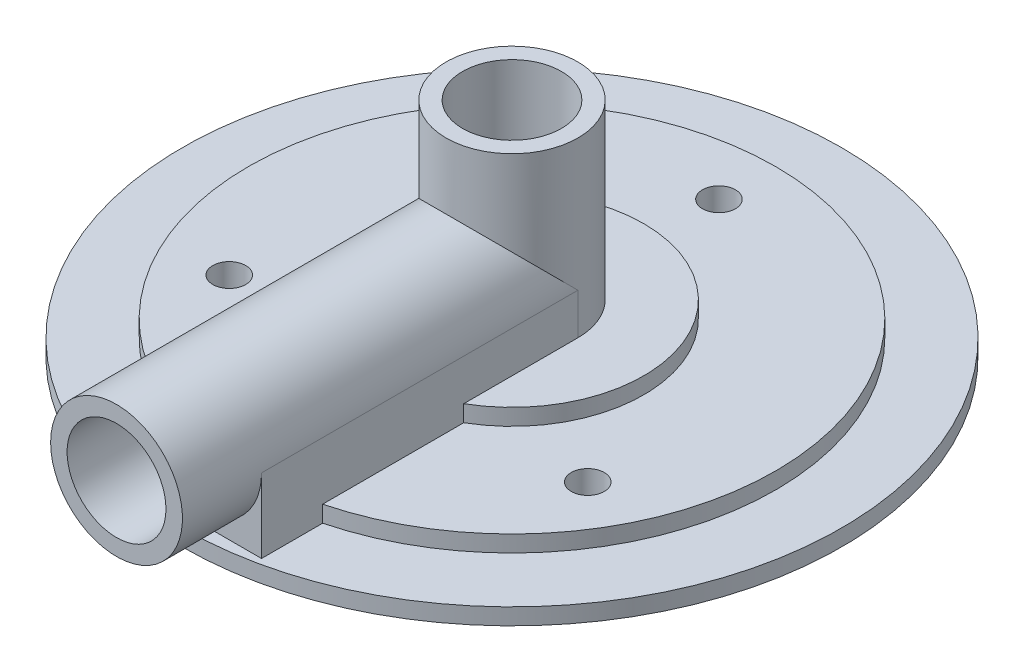
ISO-10303-21;
HEADER;
FILE_DESCRIPTION(('STEP AP214'),'2;1');
FILE_NAME('part.step','',(''),(''),'','','');
FILE_SCHEMA(('AUTOMOTIVE_DESIGN { 1 0 10303 214 1 1 1 1 }'));
ENDSEC;
DATA;
#1=APPLICATION_CONTEXT('core data for automotive mechanical design processes');
#2=APPLICATION_PROTOCOL_DEFINITION('international standard','automotive_design',2000,#1);
#3=PRODUCT_CONTEXT('',#1,'mechanical');
#4=PRODUCT('Part','Part','',(#3));
#5=PRODUCT_RELATED_PRODUCT_CATEGORY('part','',(#4));
#6=PRODUCT_DEFINITION_FORMATION('','',#4);
#7=PRODUCT_DEFINITION_CONTEXT('part definition',#1,'design');
#8=PRODUCT_DEFINITION('design','',#6,#7);
#9=PRODUCT_DEFINITION_SHAPE('','',#8);
#10=(LENGTH_UNIT() NAMED_UNIT(*) SI_UNIT(.MILLI.,.METRE.));
#11=(NAMED_UNIT(*) PLANE_ANGLE_UNIT() SI_UNIT($,.RADIAN.));
#12=(NAMED_UNIT(*) SI_UNIT($,.STERADIAN.) SOLID_ANGLE_UNIT());
#13=UNCERTAINTY_MEASURE_WITH_UNIT(LENGTH_MEASURE(1.E-05),#10,'distance_accuracy_value','');
#14=(GEOMETRIC_REPRESENTATION_CONTEXT(3) GLOBAL_UNCERTAINTY_ASSIGNED_CONTEXT((#13)) GLOBAL_UNIT_ASSIGNED_CONTEXT((#10,
#11,#12)) REPRESENTATION_CONTEXT('',''));
#15=CARTESIAN_POINT('',(0.,0.,0.));
#16=DIRECTION('',(0.,0.,1.));
#17=DIRECTION('',(1.,0.,0.));
#18=AXIS2_PLACEMENT_3D('',#15,#16,#17);
#19=CARTESIAN_POINT('',(0.,20.6375,0.));
#20=DIRECTION('',(0.,1.,0.));
#21=DIRECTION('',(0.,0.,1.));
#22=AXIS2_PLACEMENT_3D('',#19,#20,#21);
#23=CYLINDRICAL_SURFACE('',#22,6.35);
#24=CARTESIAN_POINT('',(0.,20.6375,0.));
#25=DIRECTION('',(0.,1.,0.));
#26=DIRECTION('',(0.,0.,1.));
#27=AXIS2_PLACEMENT_3D('',#24,#25,#26);
#28=CIRCLE('',#27,6.35);
#29=CARTESIAN_POINT('',(0.,20.6375,6.35));
#30=VERTEX_POINT('',#29);
#31=EDGE_CURVE('E117',#30,#30,#28,.T.);
#32=ORIENTED_EDGE('',*,*,#31,.F.);
#33=EDGE_LOOP('',(#32));
#34=FACE_BOUND('',#33,.T.);
#35=DIRECTION('',(0.,1.,0.));
#36=VECTOR('',#35,1.);
#37=CARTESIAN_POINT('',(6.35,20.6375,0.));
#38=LINE('',#37,#36);
#39=CARTESIAN_POINT('',(6.35,7.9375,0.));
#40=VERTEX_POINT('',#39);
#41=CARTESIAN_POINT('',(6.35,3.96875,0.));
#42=VERTEX_POINT('',#41);
#43=EDGE_CURVE('E168',#40,#42,#38,.F.);
#44=ORIENTED_EDGE('',*,*,#43,.T.);
#45=CARTESIAN_POINT('',(0.,3.96875,0.));
#46=DIRECTION('',(0.,1.,0.));
#47=DIRECTION('',(0.,0.,1.));
#48=AXIS2_PLACEMENT_3D('',#45,#46,#47);
#49=CIRCLE('',#48,6.35);
#50=CARTESIAN_POINT('',(-6.35,3.96875,0.));
#51=VERTEX_POINT('',#50);
#52=EDGE_CURVE('E243',#42,#51,#49,.T.);
#53=ORIENTED_EDGE('',*,*,#52,.T.);
#54=DIRECTION('',(0.,1.,0.));
#55=VECTOR('',#54,1.);
#56=CARTESIAN_POINT('',(-6.35,20.6375,0.));
#57=LINE('',#56,#55);
#58=CARTESIAN_POINT('',(-6.35,7.9375,0.));
#59=VERTEX_POINT('',#58);
#60=EDGE_CURVE('E159',#59,#51,#57,.F.);
#61=ORIENTED_EDGE('',*,*,#60,.F.);
#62=CARTESIAN_POINT('',(0.,7.9375,0.));
#63=DIRECTION('',(0.,0.707106781186547,-0.707106781186547));
#64=DIRECTION('',(0.,0.707106781186547,0.707106781186547));
#65=AXIS2_PLACEMENT_3D('',#62,#63,#64);
#66=ELLIPSE('',#65,8.98025612106916,6.35);
#67=EDGE_CURVE('E200',#40,#59,#66,.F.);
#68=ORIENTED_EDGE('',*,*,#67,.F.);
#69=EDGE_LOOP('',(#44,#53,#61,#68));
#70=FACE_BOUND('',#69,.T.);
#71=ADVANCED_FACE('F43',(#34,#70),#23,.T.);
#72=CARTESIAN_POINT('',(6.35,3.96875,0.));
#73=DIRECTION('',(0.,-1.,0.));
#74=DIRECTION('',(0.,0.,-1.));
#75=AXIS2_PLACEMENT_3D('',#72,#73,#74);
#76=PLANE('',#75);
#77=DIRECTION('',(0.,0.,1.));
#78=VECTOR('',#77,1.);
#79=CARTESIAN_POINT('',(6.35,3.96875,-31.752));
#80=LINE('',#79,#78);
#81=CARTESIAN_POINT('',(6.35,3.96875,10.9985226280624));
#82=VERTEX_POINT('',#81);
#83=EDGE_CURVE('E178',#42,#82,#80,.T.);
#84=ORIENTED_EDGE('',*,*,#83,.T.);
#85=CARTESIAN_POINT('',(0.,3.96875,0.));
#86=DIRECTION('',(0.,1.,0.));
#87=DIRECTION('',(0.,0.,1.));
#88=AXIS2_PLACEMENT_3D('',#85,#86,#87);
#89=CIRCLE('',#88,12.7);
#90=CARTESIAN_POINT('',(-6.35,3.96875,10.9985226280624));
#91=VERTEX_POINT('',#90);
#92=EDGE_CURVE('E240',#82,#91,#89,.T.);
#93=ORIENTED_EDGE('',*,*,#92,.T.);
#94=DIRECTION('',(0.,0.,-1.));
#95=VECTOR('',#94,1.);
#96=CARTESIAN_POINT('',(-6.35,3.96875,-31.752));
#97=LINE('',#96,#95);
#98=EDGE_CURVE('E66',#91,#51,#97,.T.);
#99=ORIENTED_EDGE('',*,*,#98,.T.);
#100=ORIENTED_EDGE('',*,*,#52,.F.);
#101=EDGE_LOOP('',(#84,#93,#99,#100));
#102=FACE_BOUND('',#101,.T.);
#103=ADVANCED_FACE('F284',(#102),#76,.F.);
#104=CARTESIAN_POINT('',(0.,20.6375,0.));
#105=DIRECTION('',(0.,1.,0.));
#106=DIRECTION('',(0.,0.,1.));
#107=AXIS2_PLACEMENT_3D('',#104,#105,#106);
#108=CYLINDRICAL_SURFACE('',#107,12.7);
#109=DIRECTION('',(0.,1.,0.));
#110=VECTOR('',#109,1.);
#111=CARTESIAN_POINT('',(6.35,20.6375,10.9985226280624));
#112=LINE('',#111,#110);
#113=CARTESIAN_POINT('',(6.35,2.38125,10.9985226280624));
#114=VERTEX_POINT('',#113);
#115=EDGE_CURVE('E172',#82,#114,#112,.F.);
#116=ORIENTED_EDGE('',*,*,#115,.T.);
#117=CARTESIAN_POINT('',(0.,2.38125,0.));
#118=DIRECTION('',(0.,1.,0.));
#119=DIRECTION('',(0.,0.,1.));
#120=AXIS2_PLACEMENT_3D('',#117,#118,#119);
#121=CIRCLE('',#120,12.7);
#122=CARTESIAN_POINT('',(-6.35,2.38125,10.9985226280624));
#123=VERTEX_POINT('',#122);
#124=EDGE_CURVE('E236',#114,#123,#121,.T.);
#125=ORIENTED_EDGE('',*,*,#124,.T.);
#126=DIRECTION('',(0.,1.,0.));
#127=VECTOR('',#126,1.);
#128=CARTESIAN_POINT('',(-6.35,20.6375,10.9985226280624));
#129=LINE('',#128,#127);
#130=EDGE_CURVE('E179',#123,#91,#129,.T.);
#131=ORIENTED_EDGE('',*,*,#130,.T.);
#132=ORIENTED_EDGE('',*,*,#92,.F.);
#133=EDGE_LOOP('',(#116,#125,#131,#132));
#134=FACE_BOUND('',#133,.T.);
#135=ADVANCED_FACE('F295',(#134),#108,.T.);
#136=CARTESIAN_POINT('',(12.7,2.38125,0.));
#137=DIRECTION('',(0.,-1.,0.));
#138=DIRECTION('',(0.,0.,-1.));
#139=AXIS2_PLACEMENT_3D('',#136,#137,#138);
#140=PLANE('',#139);
#141=CARTESIAN_POINT('',(0.,2.38125,-19.939));
#142=DIRECTION('',(0.,1.,0.));
#143=DIRECTION('',(0.,0.,1.));
#144=AXIS2_PLACEMENT_3D('',#141,#142,#143);
#145=CIRCLE('',#144,1.58750000000001);
#146=CARTESIAN_POINT('',(0.,2.38125,-18.3515));
#147=VERTEX_POINT('',#146);
#148=EDGE_CURVE('E269',#147,#147,#145,.T.);
#149=ORIENTED_EDGE('',*,*,#148,.F.);
#150=EDGE_LOOP('',(#149));
#151=FACE_BOUND('',#150,.T.);
#152=CARTESIAN_POINT('',(17.2676805260579,2.38125,9.9695));
#153=DIRECTION('',(0.,1.,0.));
#154=DIRECTION('',(0.,0.,1.));
#155=AXIS2_PLACEMENT_3D('',#152,#153,#154);
#156=CIRCLE('',#155,1.58750000000001);
#157=CARTESIAN_POINT('',(17.2676805260579,2.38125,11.557));
#158=VERTEX_POINT('',#157);
#159=EDGE_CURVE('E256',#158,#158,#156,.T.);
#160=ORIENTED_EDGE('',*,*,#159,.F.);
#161=EDGE_LOOP('',(#160));
#162=FACE_BOUND('',#161,.T.);
#163=CARTESIAN_POINT('',(-17.2676805260579,2.38125,9.96949999999999));
#164=DIRECTION('',(0.,1.,0.));
#165=DIRECTION('',(0.,0.,1.));
#166=AXIS2_PLACEMENT_3D('',#163,#164,#165);
#167=CIRCLE('',#166,1.58750000000001);
#168=CARTESIAN_POINT('',(-17.2676805260579,2.38125,11.557));
#169=VERTEX_POINT('',#168);
#170=EDGE_CURVE('E252',#169,#169,#167,.T.);
#171=ORIENTED_EDGE('',*,*,#170,.F.);
#172=EDGE_LOOP('',(#171));
#173=FACE_BOUND('',#172,.T.);
#174=DIRECTION('',(0.,0.,1.));
#175=VECTOR('',#174,1.);
#176=CARTESIAN_POINT('',(6.35,2.38125,-31.752));
#177=LINE('',#176,#175);
#178=CARTESIAN_POINT('',(6.35,2.38125,24.5934442484171));
#179=VERTEX_POINT('',#178);
#180=EDGE_CURVE('E169',#114,#179,#177,.T.);
#181=ORIENTED_EDGE('',*,*,#180,.T.);
#182=CARTESIAN_POINT('',(0.,2.38125,0.));
#183=DIRECTION('',(0.,1.,0.));
#184=DIRECTION('',(0.,0.,1.));
#185=AXIS2_PLACEMENT_3D('',#182,#183,#184);
#186=CIRCLE('',#185,25.4);
#187=CARTESIAN_POINT('',(-6.35,2.38125,24.5934442484171));
#188=VERTEX_POINT('',#187);
#189=EDGE_CURVE('E232',#179,#188,#186,.T.);
#190=ORIENTED_EDGE('',*,*,#189,.T.);
#191=DIRECTION('',(0.,0.,-1.));
#192=VECTOR('',#191,1.);
#193=CARTESIAN_POINT('',(-6.35,2.38125,-31.752));
#194=LINE('',#193,#192);
#195=EDGE_CURVE('E182',#188,#123,#194,.T.);
#196=ORIENTED_EDGE('',*,*,#195,.T.);
#197=ORIENTED_EDGE('',*,*,#124,.F.);
#198=EDGE_LOOP('',(#181,#190,#196,#197));
#199=FACE_BOUND('',#198,.T.);
#200=ADVANCED_FACE('F298',(#151,#162,#173,#199),#140,.F.);
#201=CARTESIAN_POINT('',(0.,20.6375,0.));
#202=DIRECTION('',(0.,1.,0.));
#203=DIRECTION('',(0.,0.,1.));
#204=AXIS2_PLACEMENT_3D('',#201,#202,#203);
#205=CYLINDRICAL_SURFACE('',#204,25.4);
#206=DIRECTION('',(0.,1.,0.));
#207=VECTOR('',#206,1.);
#208=CARTESIAN_POINT('',(6.35,20.6375,24.5934442484171));
#209=LINE('',#208,#207);
#210=CARTESIAN_POINT('',(6.35,0.793749999999999,24.5934442484171));
#211=VERTEX_POINT('',#210);
#212=EDGE_CURVE('E173',#179,#211,#209,.F.);
#213=ORIENTED_EDGE('',*,*,#212,.T.);
#214=CARTESIAN_POINT('',(0.,0.793749999999999,0.));
#215=DIRECTION('',(0.,1.,0.));
#216=DIRECTION('',(0.,0.,1.));
#217=AXIS2_PLACEMENT_3D('',#214,#215,#216);
#218=CIRCLE('',#217,25.4);
#219=CARTESIAN_POINT('',(-6.35,0.793749999999999,24.5934442484171));
#220=VERTEX_POINT('',#219);
#221=EDGE_CURVE('E228',#211,#220,#218,.T.);
#222=ORIENTED_EDGE('',*,*,#221,.T.);
#223=DIRECTION('',(0.,1.,0.));
#224=VECTOR('',#223,1.);
#225=CARTESIAN_POINT('',(-6.35,20.6375,24.5934442484171));
#226=LINE('',#225,#224);
#227=EDGE_CURVE('E188',#220,#188,#226,.T.);
#228=ORIENTED_EDGE('',*,*,#227,.T.);
#229=ORIENTED_EDGE('',*,*,#189,.F.);
#230=EDGE_LOOP('',(#213,#222,#228,#229));
#231=FACE_BOUND('',#230,.T.);
#232=ADVANCED_FACE('F317',(#231),#205,.T.);
#233=CARTESIAN_POINT('',(25.4,0.79375,0.));
#234=DIRECTION('',(0.,-1.,0.));
#235=DIRECTION('',(0.,0.,-1.));
#236=AXIS2_PLACEMENT_3D('',#233,#234,#235);
#237=PLANE('',#236);
#238=CARTESIAN_POINT('',(0.,0.793749999999999,0.));
#239=DIRECTION('',(0.,1.,0.));
#240=DIRECTION('',(0.,0.,1.));
#241=AXIS2_PLACEMENT_3D('',#238,#239,#240);
#242=CIRCLE('',#241,31.75);
#243=CARTESIAN_POINT('',(0.,0.793749999999999,31.75));
#244=VERTEX_POINT('',#243);
#245=EDGE_CURVE('E224',#244,#244,#242,.T.);
#246=ORIENTED_EDGE('',*,*,#245,.T.);
#247=EDGE_LOOP('',(#246));
#248=FACE_BOUND('',#247,.T.);
#249=DIRECTION('',(0.,0.,1.));
#250=VECTOR('',#249,1.);
#251=CARTESIAN_POINT('',(6.35,0.793749999999999,-31.752));
#252=LINE('',#251,#250);
#253=CARTESIAN_POINT('',(6.35,0.79375,30.48));
#254=VERTEX_POINT('',#253);
#255=EDGE_CURVE('E160',#211,#254,#252,.T.);
#256=ORIENTED_EDGE('',*,*,#255,.T.);
#257=DIRECTION('',(-1.,0.,0.));
#258=VECTOR('',#257,1.);
#259=CARTESIAN_POINT('',(-6.35,0.793749999999999,30.48));
#260=LINE('',#259,#258);
#261=CARTESIAN_POINT('',(-6.35,0.79375,30.48));
#262=VERTEX_POINT('',#261);
#263=EDGE_CURVE('E136',#254,#262,#260,.T.);
#264=ORIENTED_EDGE('',*,*,#263,.T.);
#265=DIRECTION('',(0.,0.,1.));
#266=VECTOR('',#265,1.);
#267=CARTESIAN_POINT('',(-6.35,0.793749999999999,-31.752));
#268=LINE('',#267,#266);
#269=EDGE_CURVE('E155',#220,#262,#268,.T.);
#270=ORIENTED_EDGE('',*,*,#269,.F.);
#271=ORIENTED_EDGE('',*,*,#221,.F.);
#272=EDGE_LOOP('',(#256,#264,#270,#271));
#273=FACE_BOUND('',#272,.T.);
#274=ADVANCED_FACE('F279',(#248,#273),#237,.F.);
#275=CARTESIAN_POINT('',(0.,20.6375,0.));
#276=DIRECTION('',(0.,-1.,0.));
#277=DIRECTION('',(0.,0.,-1.));
#278=AXIS2_PLACEMENT_3D('',#275,#276,#277);
#279=PLANE('',#278);
#280=CARTESIAN_POINT('',(0.,20.6375,0.));
#281=DIRECTION('',(0.,1.,0.));
#282=DIRECTION('',(0.,0.,1.));
#283=AXIS2_PLACEMENT_3D('',#280,#281,#282);
#284=CIRCLE('',#283,4.76250000000001);
#285=CARTESIAN_POINT('',(0.,20.6375,4.76250000000001));
#286=VERTEX_POINT('',#285);
#287=EDGE_CURVE('E139',#286,#286,#284,.T.);
#288=ORIENTED_EDGE('',*,*,#287,.F.);
#289=EDGE_LOOP('',(#288));
#290=FACE_BOUND('',#289,.T.);
#291=ORIENTED_EDGE('',*,*,#31,.T.);
#292=EDGE_LOOP('',(#291));
#293=FACE_BOUND('',#292,.T.);
#294=ADVANCED_FACE('F45',(#290,#293),#279,.F.);
#295=CARTESIAN_POINT('',(0.,20.6375,0.));
#296=DIRECTION('',(0.,1.,0.));
#297=DIRECTION('',(0.,0.,1.));
#298=AXIS2_PLACEMENT_3D('',#295,#296,#297);
#299=CYLINDRICAL_SURFACE('',#298,31.75);
#300=ORIENTED_EDGE('',*,*,#245,.F.);
#301=EDGE_LOOP('',(#300));
#302=FACE_BOUND('',#301,.T.);
#303=CARTESIAN_POINT('',(0.,-0.793749999999999,0.));
#304=DIRECTION('',(0.,1.,0.));
#305=DIRECTION('',(0.,0.,1.));
#306=AXIS2_PLACEMENT_3D('',#303,#304,#305);
#307=CIRCLE('',#306,31.75);
#308=CARTESIAN_POINT('',(0.,-0.793749999999999,31.75));
#309=VERTEX_POINT('',#308);
#310=EDGE_CURVE('E220',#309,#309,#307,.T.);
#311=ORIENTED_EDGE('',*,*,#310,.T.);
#312=EDGE_LOOP('',(#311));
#313=FACE_BOUND('',#312,.T.);
#314=ADVANCED_FACE('F278',(#302,#313),#299,.T.);
#315=CARTESIAN_POINT('',(25.4,-0.79375,0.));
#316=DIRECTION('',(0.,1.,0.));
#317=DIRECTION('',(0.,0.,1.));
#318=AXIS2_PLACEMENT_3D('',#315,#316,#317);
#319=PLANE('',#318);
#320=ORIENTED_EDGE('',*,*,#310,.F.);
#321=EDGE_LOOP('',(#320));
#322=FACE_BOUND('',#321,.T.);
#323=CARTESIAN_POINT('',(0.,-0.793749999999999,0.));
#324=DIRECTION('',(0.,1.,0.));
#325=DIRECTION('',(0.,0.,1.));
#326=AXIS2_PLACEMENT_3D('',#323,#324,#325);
#327=CIRCLE('',#326,25.4);
#328=CARTESIAN_POINT('',(0.,-0.793749999999999,25.4));
#329=VERTEX_POINT('',#328);
#330=EDGE_CURVE('E216',#329,#329,#327,.T.);
#331=ORIENTED_EDGE('',*,*,#330,.T.);
#332=EDGE_LOOP('',(#331));
#333=FACE_BOUND('',#332,.T.);
#334=ADVANCED_FACE('F525',(#322,#333),#319,.F.);
#335=CARTESIAN_POINT('',(0.,20.6375,0.));
#336=DIRECTION('',(0.,1.,0.));
#337=DIRECTION('',(0.,0.,1.));
#338=AXIS2_PLACEMENT_3D('',#335,#336,#337);
#339=CYLINDRICAL_SURFACE('',#338,25.4);
#340=ORIENTED_EDGE('',*,*,#330,.F.);
#341=EDGE_LOOP('',(#340));
#342=FACE_BOUND('',#341,.T.);
#343=CARTESIAN_POINT('',(0.,-2.38125,0.));
#344=DIRECTION('',(0.,1.,0.));
#345=DIRECTION('',(0.,0.,1.));
#346=AXIS2_PLACEMENT_3D('',#343,#344,#345);
#347=CIRCLE('',#346,25.4);
#348=CARTESIAN_POINT('',(0.,-2.38125,25.4));
#349=VERTEX_POINT('',#348);
#350=EDGE_CURVE('E212',#349,#349,#347,.T.);
#351=ORIENTED_EDGE('',*,*,#350,.T.);
#352=EDGE_LOOP('',(#351));
#353=FACE_BOUND('',#352,.T.);
#354=ADVANCED_FACE('F362',(#342,#353),#339,.T.);
#355=CARTESIAN_POINT('',(12.7,-2.38125,0.));
#356=DIRECTION('',(0.,1.,0.));
#357=DIRECTION('',(0.,0.,1.));
#358=AXIS2_PLACEMENT_3D('',#355,#356,#357);
#359=PLANE('',#358);
#360=CARTESIAN_POINT('',(0.,-2.38125,-19.939));
#361=DIRECTION('',(0.,1.,0.));
#362=DIRECTION('',(0.,0.,1.));
#363=AXIS2_PLACEMENT_3D('',#360,#361,#362);
#364=CIRCLE('',#363,1.58750000000001);
#365=CARTESIAN_POINT('',(0.,-2.38125,-18.3515));
#366=VERTEX_POINT('',#365);
#367=EDGE_CURVE('E47',#366,#366,#364,.T.);
#368=ORIENTED_EDGE('',*,*,#367,.T.);
#369=EDGE_LOOP('',(#368));
#370=FACE_BOUND('',#369,.T.);
#371=CARTESIAN_POINT('',(17.2676805260579,-2.38125,9.9695));
#372=DIRECTION('',(0.,1.,0.));
#373=DIRECTION('',(0.,0.,1.));
#374=AXIS2_PLACEMENT_3D('',#371,#372,#373);
#375=CIRCLE('',#374,1.58750000000001);
#376=CARTESIAN_POINT('',(17.2676805260579,-2.38125,11.557));
#377=VERTEX_POINT('',#376);
#378=EDGE_CURVE('E253',#377,#377,#375,.T.);
#379=ORIENTED_EDGE('',*,*,#378,.T.);
#380=EDGE_LOOP('',(#379));
#381=FACE_BOUND('',#380,.T.);
#382=CARTESIAN_POINT('',(-17.2676805260579,-2.38125,9.96949999999999));
#383=DIRECTION('',(0.,1.,0.));
#384=DIRECTION('',(0.,0.,1.));
#385=AXIS2_PLACEMENT_3D('',#382,#383,#384);
#386=CIRCLE('',#385,1.58750000000001);
#387=CARTESIAN_POINT('',(-17.2676805260579,-2.38125,11.557));
#388=VERTEX_POINT('',#387);
#389=EDGE_CURVE('E249',#388,#388,#386,.T.);
#390=ORIENTED_EDGE('',*,*,#389,.T.);
#391=EDGE_LOOP('',(#390));
#392=FACE_BOUND('',#391,.T.);
#393=ORIENTED_EDGE('',*,*,#350,.F.);
#394=EDGE_LOOP('',(#393));
#395=FACE_BOUND('',#394,.T.);
#396=CARTESIAN_POINT('',(0.,-2.38125,0.));
#397=DIRECTION('',(0.,1.,0.));
#398=DIRECTION('',(0.,0.,1.));
#399=AXIS2_PLACEMENT_3D('',#396,#397,#398);
#400=CIRCLE('',#399,12.7);
#401=CARTESIAN_POINT('',(0.,-2.38125,12.7));
#402=VERTEX_POINT('',#401);
#403=EDGE_CURVE('E208',#402,#402,#400,.T.);
#404=ORIENTED_EDGE('',*,*,#403,.T.);
#405=EDGE_LOOP('',(#404));
#406=FACE_BOUND('',#405,.T.);
#407=ADVANCED_FACE('F356',(#370,#381,#392,#395,#406),#359,.F.);
#408=CARTESIAN_POINT('',(0.,20.6375,0.));
#409=DIRECTION('',(0.,1.,0.));
#410=DIRECTION('',(0.,0.,1.));
#411=AXIS2_PLACEMENT_3D('',#408,#409,#410);
#412=CYLINDRICAL_SURFACE('',#411,12.7);
#413=ORIENTED_EDGE('',*,*,#403,.F.);
#414=EDGE_LOOP('',(#413));
#415=FACE_BOUND('',#414,.T.);
#416=CARTESIAN_POINT('',(0.,-3.96875,0.));
#417=DIRECTION('',(0.,1.,0.));
#418=DIRECTION('',(0.,0.,1.));
#419=AXIS2_PLACEMENT_3D('',#416,#417,#418);
#420=CIRCLE('',#419,12.7);
#421=CARTESIAN_POINT('',(0.,-3.96875,12.7));
#422=VERTEX_POINT('',#421);
#423=EDGE_CURVE('E204',#422,#422,#420,.T.);
#424=ORIENTED_EDGE('',*,*,#423,.T.);
#425=EDGE_LOOP('',(#424));
#426=FACE_BOUND('',#425,.T.);
#427=ADVANCED_FACE('F361',(#415,#426),#412,.T.);
#428=CARTESIAN_POINT('',(6.35,-3.96875,0.));
#429=DIRECTION('',(0.,1.,0.));
#430=DIRECTION('',(0.,0.,1.));
#431=AXIS2_PLACEMENT_3D('',#428,#429,#430);
#432=PLANE('',#431);
#433=CARTESIAN_POINT('',(0.,-3.96875,0.));
#434=DIRECTION('',(0.,1.,0.));
#435=DIRECTION('',(0.,0.,1.));
#436=AXIS2_PLACEMENT_3D('',#433,#434,#435);
#437=CIRCLE('',#436,4.76250000000001);
#438=CARTESIAN_POINT('',(0.,-3.96875,4.76250000000001));
#439=VERTEX_POINT('',#438);
#440=EDGE_CURVE('E131',#439,#439,#437,.T.);
#441=ORIENTED_EDGE('',*,*,#440,.T.);
#442=EDGE_LOOP('',(#441));
#443=FACE_BOUND('',#442,.T.);
#444=ORIENTED_EDGE('',*,*,#423,.F.);
#445=EDGE_LOOP('',(#444));
#446=FACE_BOUND('',#445,.T.);
#447=ADVANCED_FACE('F486',(#443,#446),#432,.F.);
#448=CARTESIAN_POINT('',(0.,7.9375,0.));
#449=DIRECTION('',(0.,0.,-1.));
#450=DIRECTION('',(-1.,0.,0.));
#451=AXIS2_PLACEMENT_3D('',#448,#449,#450);
#452=CYLINDRICAL_SURFACE('',#451,6.35);
#453=CARTESIAN_POINT('',(0.,7.9375,30.48));
#454=DIRECTION('',(0.,0.,-1.));
#455=DIRECTION('',(-1.,0.,0.));
#456=AXIS2_PLACEMENT_3D('',#453,#454,#455);
#457=CIRCLE('',#456,6.35);
#458=CARTESIAN_POINT('',(-6.35,7.9375,30.48));
#459=VERTEX_POINT('',#458);
#460=CARTESIAN_POINT('',(6.35,7.9375,30.48));
#461=VERTEX_POINT('',#460);
#462=EDGE_CURVE('E154',#459,#461,#457,.F.);
#463=ORIENTED_EDGE('',*,*,#462,.T.);
#464=DIRECTION('',(0.,0.,1.));
#465=VECTOR('',#464,1.);
#466=CARTESIAN_POINT('',(6.35,7.9375,-31.752));
#467=LINE('',#466,#465);
#468=EDGE_CURVE('E147',#40,#461,#467,.T.);
#469=ORIENTED_EDGE('',*,*,#468,.F.);
#470=ORIENTED_EDGE('',*,*,#67,.T.);
#471=DIRECTION('',(0.,0.,1.));
#472=VECTOR('',#471,1.);
#473=CARTESIAN_POINT('',(-6.35,7.9375,-31.752));
#474=LINE('',#473,#472);
#475=EDGE_CURVE('E150',#59,#459,#474,.T.);
#476=ORIENTED_EDGE('',*,*,#475,.T.);
#477=EDGE_LOOP('',(#463,#469,#470,#476));
#478=FACE_BOUND('',#477,.T.);
#479=CARTESIAN_POINT('',(0.,7.9375,38.1));
#480=DIRECTION('',(0.,0.,-1.));
#481=DIRECTION('',(-1.,0.,0.));
#482=AXIS2_PLACEMENT_3D('',#479,#480,#481);
#483=CIRCLE('',#482,6.35);
#484=CARTESIAN_POINT('',(-6.35,7.9375,38.1));
#485=VERTEX_POINT('',#484);
#486=EDGE_CURVE('E153',#485,#485,#483,.T.);
#487=ORIENTED_EDGE('',*,*,#486,.T.);
#488=EDGE_LOOP('',(#487));
#489=FACE_BOUND('',#488,.T.);
#490=ADVANCED_FACE('F306',(#478,#489),#452,.T.);
#491=CARTESIAN_POINT('',(0.,7.9375,38.1));
#492=DIRECTION('',(0.,0.,-1.));
#493=DIRECTION('',(-1.,0.,0.));
#494=AXIS2_PLACEMENT_3D('',#491,#492,#493);
#495=PLANE('',#494);
#496=CARTESIAN_POINT('',(0.,7.9375,38.1));
#497=DIRECTION('',(0.,0.,1.));
#498=DIRECTION('',(1.,0.,0.));
#499=AXIS2_PLACEMENT_3D('',#496,#497,#498);
#500=CIRCLE('',#499,4.76250000000001);
#501=CARTESIAN_POINT('',(4.76250000000001,7.9375,38.1));
#502=VERTEX_POINT('',#501);
#503=EDGE_CURVE('E127',#502,#502,#500,.T.);
#504=ORIENTED_EDGE('',*,*,#503,.F.);
#505=EDGE_LOOP('',(#504));
#506=FACE_BOUND('',#505,.T.);
#507=ORIENTED_EDGE('',*,*,#486,.F.);
#508=EDGE_LOOP('',(#507));
#509=FACE_BOUND('',#508,.T.);
#510=ADVANCED_FACE('F424',(#506,#509),#495,.F.);
#511=CARTESIAN_POINT('',(6.35,7.9375,-31.752));
#512=DIRECTION('',(-1.,0.,0.));
#513=DIRECTION('',(0.,-1.,0.));
#514=AXIS2_PLACEMENT_3D('',#511,#512,#513);
#515=PLANE('',#514);
#516=ORIENTED_EDGE('',*,*,#212,.F.);
#517=ORIENTED_EDGE('',*,*,#180,.F.);
#518=ORIENTED_EDGE('',*,*,#115,.F.);
#519=ORIENTED_EDGE('',*,*,#83,.F.);
#520=ORIENTED_EDGE('',*,*,#43,.F.);
#521=ORIENTED_EDGE('',*,*,#468,.T.);
#522=DIRECTION('',(0.,-1.,0.));
#523=VECTOR('',#522,1.);
#524=CARTESIAN_POINT('',(6.35,7.9375,30.48));
#525=LINE('',#524,#523);
#526=EDGE_CURVE('E143',#461,#254,#525,.T.);
#527=ORIENTED_EDGE('',*,*,#526,.T.);
#528=ORIENTED_EDGE('',*,*,#255,.F.);
#529=EDGE_LOOP('',(#516,#517,#518,#519,#520,#521,#527,#528));
#530=FACE_BOUND('',#529,.T.);
#531=ADVANCED_FACE('F124',(#530),#515,.F.);
#532=CARTESIAN_POINT('',(-6.35,7.9375,-31.752));
#533=DIRECTION('',(1.,0.,0.));
#534=DIRECTION('',(0.,0.,-1.));
#535=AXIS2_PLACEMENT_3D('',#532,#533,#534);
#536=PLANE('',#535);
#537=ORIENTED_EDGE('',*,*,#227,.F.);
#538=ORIENTED_EDGE('',*,*,#269,.T.);
#539=DIRECTION('',(0.,1.,0.));
#540=VECTOR('',#539,1.);
#541=CARTESIAN_POINT('',(-6.35,7.9375,30.48));
#542=LINE('',#541,#540);
#543=EDGE_CURVE('E130',#262,#459,#542,.T.);
#544=ORIENTED_EDGE('',*,*,#543,.T.);
#545=ORIENTED_EDGE('',*,*,#475,.F.);
#546=ORIENTED_EDGE('',*,*,#60,.T.);
#547=ORIENTED_EDGE('',*,*,#98,.F.);
#548=ORIENTED_EDGE('',*,*,#130,.F.);
#549=ORIENTED_EDGE('',*,*,#195,.F.);
#550=EDGE_LOOP('',(#537,#538,#544,#545,#546,#547,#548,#549));
#551=FACE_BOUND('',#550,.T.);
#552=ADVANCED_FACE('F303',(#551),#536,.F.);
#553=CARTESIAN_POINT('',(0.,0.,30.48));
#554=DIRECTION('',(0.,0.,-1.));
#555=DIRECTION('',(-1.,0.,0.));
#556=AXIS2_PLACEMENT_3D('',#553,#554,#555);
#557=PLANE('',#556);
#558=ORIENTED_EDGE('',*,*,#462,.F.);
#559=ORIENTED_EDGE('',*,*,#543,.F.);
#560=ORIENTED_EDGE('',*,*,#263,.F.);
#561=ORIENTED_EDGE('',*,*,#526,.F.);
#562=EDGE_LOOP('',(#558,#559,#560,#561));
#563=FACE_BOUND('',#562,.T.);
#564=ADVANCED_FACE('F122',(#563),#557,.F.);
#565=CARTESIAN_POINT('',(0.,7.9375,38.1));
#566=DIRECTION('',(0.,0.,1.));
#567=DIRECTION('',(1.,0.,0.));
#568=AXIS2_PLACEMENT_3D('',#565,#566,#567);
#569=CYLINDRICAL_SURFACE('',#568,4.76250000000001);
#570=CARTESIAN_POINT('',(0.,7.9375,0.));
#571=DIRECTION('',(0.,-0.707106781186547,0.707106781186547));
#572=DIRECTION('',(0.,0.707106781186547,0.707106781186547));
#573=AXIS2_PLACEMENT_3D('',#570,#571,#572);
#574=ELLIPSE('',#573,6.73519209080188,4.76250000000001);
#575=CARTESIAN_POINT('',(-4.76250000000001,7.9375,0.));
#576=VERTEX_POINT('',#575);
#577=CARTESIAN_POINT('',(4.76250000000001,7.9375,0.));
#578=VERTEX_POINT('',#577);
#579=EDGE_CURVE('E53',#576,#578,#574,.F.);
#580=ORIENTED_EDGE('',*,*,#579,.T.);
#581=CARTESIAN_POINT('',(0.,7.9375,0.));
#582=DIRECTION('',(0.,0.707106781186547,0.707106781186547));
#583=DIRECTION('',(0.,-0.707106781186547,0.707106781186547));
#584=AXIS2_PLACEMENT_3D('',#581,#582,#583);
#585=ELLIPSE('',#584,6.73519209080188,4.76250000000001);
#586=EDGE_CURVE('E11',#578,#576,#585,.F.);
#587=ORIENTED_EDGE('',*,*,#586,.T.);
#588=EDGE_LOOP('',(#580,#587));
#589=FACE_BOUND('',#588,.T.);
#590=ORIENTED_EDGE('',*,*,#503,.T.);
#591=EDGE_LOOP('',(#590));
#592=FACE_BOUND('',#591,.T.);
#593=ADVANCED_FACE('F119',(#589,#592),#569,.F.);
#594=CARTESIAN_POINT('',(0.,20.6375,0.));
#595=DIRECTION('',(0.,1.,0.));
#596=DIRECTION('',(0.,0.,1.));
#597=AXIS2_PLACEMENT_3D('',#594,#595,#596);
#598=CYLINDRICAL_SURFACE('',#597,4.76250000000001);
#599=ORIENTED_EDGE('',*,*,#440,.F.);
#600=EDGE_LOOP('',(#599));
#601=FACE_BOUND('',#600,.T.);
#602=ORIENTED_EDGE('',*,*,#287,.T.);
#603=EDGE_LOOP('',(#602));
#604=FACE_BOUND('',#603,.T.);
#605=ORIENTED_EDGE('',*,*,#579,.F.);
#606=ORIENTED_EDGE('',*,*,#586,.F.);
#607=EDGE_LOOP('',(#605,#606));
#608=FACE_BOUND('',#607,.T.);
#609=ADVANCED_FACE('F114',(#601,#604,#608),#598,.F.);
#610=CARTESIAN_POINT('',(-17.2676805260579,2.38125,9.96949999999999));
#611=DIRECTION('',(0.,1.,0.));
#612=DIRECTION('',(0.,0.,1.));
#613=AXIS2_PLACEMENT_3D('',#610,#611,#612);
#614=CYLINDRICAL_SURFACE('',#613,1.58750000000001);
#615=ORIENTED_EDGE('',*,*,#170,.T.);
#616=EDGE_LOOP('',(#615));
#617=FACE_BOUND('',#616,.T.);
#618=ORIENTED_EDGE('',*,*,#389,.F.);
#619=EDGE_LOOP('',(#618));
#620=FACE_BOUND('',#619,.T.);
#621=ADVANCED_FACE('F373',(#617,#620),#614,.F.);
#622=CARTESIAN_POINT('',(17.2676805260579,2.38125,9.9695));
#623=DIRECTION('',(0.,1.,0.));
#624=DIRECTION('',(0.,0.,1.));
#625=AXIS2_PLACEMENT_3D('',#622,#623,#624);
#626=CYLINDRICAL_SURFACE('',#625,1.58750000000001);
#627=ORIENTED_EDGE('',*,*,#159,.T.);
#628=EDGE_LOOP('',(#627));
#629=FACE_BOUND('',#628,.T.);
#630=ORIENTED_EDGE('',*,*,#378,.F.);
#631=EDGE_LOOP('',(#630));
#632=FACE_BOUND('',#631,.T.);
#633=ADVANCED_FACE('F378',(#629,#632),#626,.F.);
#634=CARTESIAN_POINT('',(0.,2.38125,-19.939));
#635=DIRECTION('',(0.,1.,0.));
#636=DIRECTION('',(0.,0.,1.));
#637=AXIS2_PLACEMENT_3D('',#634,#635,#636);
#638=CYLINDRICAL_SURFACE('',#637,1.58750000000001);
#639=ORIENTED_EDGE('',*,*,#148,.T.);
#640=EDGE_LOOP('',(#639));
#641=FACE_BOUND('',#640,.T.);
#642=ORIENTED_EDGE('',*,*,#367,.F.);
#643=EDGE_LOOP('',(#642));
#644=FACE_BOUND('',#643,.T.);
#645=ADVANCED_FACE('F389',(#641,#644),#638,.F.);
#646=CLOSED_SHELL('',(#71,#103,#135,#200,#232,#274,#294,#314,#334,#354,#407,#427,#447,#490,#510,
#531,#552,#564,#593,#609,#621,#633,#645));
#647=MANIFOLD_SOLID_BREP('B2',#646);
#648=ADVANCED_BREP_SHAPE_REPRESENTATION('',(#18,#647),#14);
#649=SHAPE_DEFINITION_REPRESENTATION(#9,#648);
ENDSEC;
END-ISO-10303-21;
